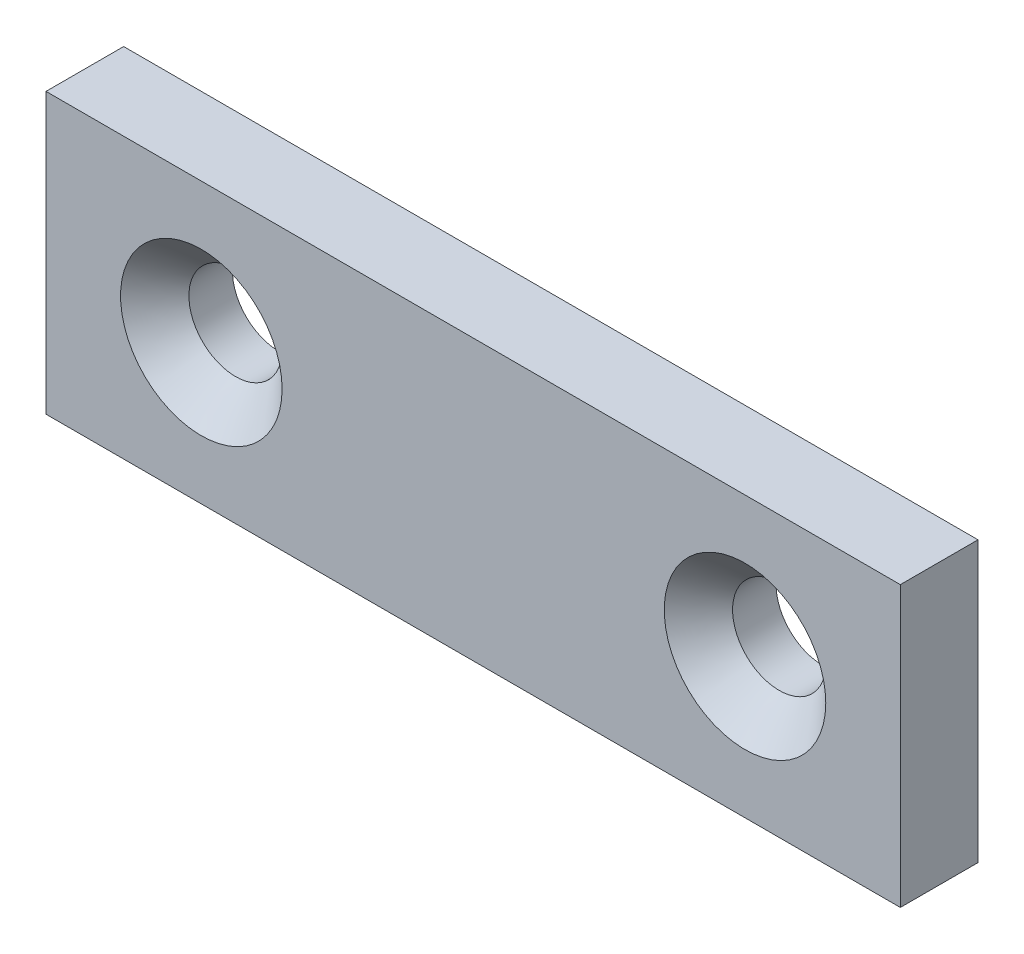
ISO-10303-21;
HEADER;
FILE_DESCRIPTION(('STEP AP214'),'2;1');
FILE_NAME('part.step','',(''),(''),'','','');
FILE_SCHEMA(('AUTOMOTIVE_DESIGN { 1 0 10303 214 1 1 1 1 }'));
ENDSEC;
DATA;
#1=APPLICATION_CONTEXT('core data for automotive mechanical design processes');
#2=APPLICATION_PROTOCOL_DEFINITION('international standard','automotive_design',2000,#1);
#3=PRODUCT_CONTEXT('',#1,'mechanical');
#4=PRODUCT('Part','Part','',(#3));
#5=PRODUCT_RELATED_PRODUCT_CATEGORY('part','',(#4));
#6=PRODUCT_DEFINITION_FORMATION('','',#4);
#7=PRODUCT_DEFINITION_CONTEXT('part definition',#1,'design');
#8=PRODUCT_DEFINITION('design','',#6,#7);
#9=PRODUCT_DEFINITION_SHAPE('','',#8);
#10=(LENGTH_UNIT() NAMED_UNIT(*) SI_UNIT(.MILLI.,.METRE.));
#11=(NAMED_UNIT(*) PLANE_ANGLE_UNIT() SI_UNIT($,.RADIAN.));
#12=(NAMED_UNIT(*) SI_UNIT($,.STERADIAN.) SOLID_ANGLE_UNIT());
#13=UNCERTAINTY_MEASURE_WITH_UNIT(LENGTH_MEASURE(1.E-05),#10,'distance_accuracy_value','');
#14=(GEOMETRIC_REPRESENTATION_CONTEXT(3) GLOBAL_UNCERTAINTY_ASSIGNED_CONTEXT((#13)) GLOBAL_UNIT_ASSIGNED_CONTEXT((#10,
#11,#12)) REPRESENTATION_CONTEXT('',''));
#15=CARTESIAN_POINT('',(0.,0.,0.));
#16=DIRECTION('',(0.,0.,1.));
#17=DIRECTION('',(1.,0.,0.));
#18=AXIS2_PLACEMENT_3D('',#15,#16,#17);
#19=CARTESIAN_POINT('',(0.,0.,2.5));
#20=DIRECTION('',(1.,0.,0.));
#21=DIRECTION('',(0.,0.,-1.));
#22=AXIS2_PLACEMENT_3D('',#19,#20,#21);
#23=PLANE('',#22);
#24=DIRECTION('',(0.,-1.,0.));
#25=VECTOR('',#24,1.);
#26=CARTESIAN_POINT('',(0.,0.,-2.5));
#27=LINE('',#26,#25);
#28=CARTESIAN_POINT('',(0.,18.,-2.5));
#29=VERTEX_POINT('',#28);
#30=CARTESIAN_POINT('',(0.,0.,-2.5));
#31=VERTEX_POINT('',#30);
#32=EDGE_CURVE('E97',#29,#31,#27,.T.);
#33=ORIENTED_EDGE('',*,*,#32,.T.);
#34=DIRECTION('',(0.,0.,-1.));
#35=VECTOR('',#34,1.);
#36=CARTESIAN_POINT('',(0.,0.,2.5));
#37=LINE('',#36,#35);
#38=CARTESIAN_POINT('',(0.,0.,2.5));
#39=VERTEX_POINT('',#38);
#40=EDGE_CURVE('E11',#39,#31,#37,.T.);
#41=ORIENTED_EDGE('',*,*,#40,.F.);
#42=DIRECTION('',(0.,-1.,0.));
#43=VECTOR('',#42,1.);
#44=CARTESIAN_POINT('',(0.,0.,2.5));
#45=LINE('',#44,#43);
#46=CARTESIAN_POINT('',(0.,18.,2.5));
#47=VERTEX_POINT('',#46);
#48=EDGE_CURVE('E85',#47,#39,#45,.T.);
#49=ORIENTED_EDGE('',*,*,#48,.F.);
#50=DIRECTION('',(0.,0.,-1.));
#51=VECTOR('',#50,1.);
#52=CARTESIAN_POINT('',(0.,18.,2.5));
#53=LINE('',#52,#51);
#54=EDGE_CURVE('E93',#47,#29,#53,.T.);
#55=ORIENTED_EDGE('',*,*,#54,.T.);
#56=EDGE_LOOP('',(#33,#41,#49,#55));
#57=FACE_BOUND('',#56,.T.);
#58=ADVANCED_FACE('F34',(#57),#23,.F.);
#59=CARTESIAN_POINT('',(0.,0.,2.5));
#60=DIRECTION('',(0.,1.,0.));
#61=DIRECTION('',(0.,0.,1.));
#62=AXIS2_PLACEMENT_3D('',#59,#60,#61);
#63=PLANE('',#62);
#64=DIRECTION('',(1.,0.,0.));
#65=VECTOR('',#64,1.);
#66=CARTESIAN_POINT('',(0.,0.,-2.5));
#67=LINE('',#66,#65);
#68=CARTESIAN_POINT('',(55.,0.,-2.5));
#69=VERTEX_POINT('',#68);
#70=EDGE_CURVE('E89',#31,#69,#67,.T.);
#71=ORIENTED_EDGE('',*,*,#70,.T.);
#72=DIRECTION('',(0.,0.,-1.));
#73=VECTOR('',#72,1.);
#74=CARTESIAN_POINT('',(55.,0.,2.5));
#75=LINE('',#74,#73);
#76=CARTESIAN_POINT('',(55.,0.,2.5));
#77=VERTEX_POINT('',#76);
#78=EDGE_CURVE('E42',#77,#69,#75,.T.);
#79=ORIENTED_EDGE('',*,*,#78,.F.);
#80=DIRECTION('',(1.,0.,0.));
#81=VECTOR('',#80,1.);
#82=CARTESIAN_POINT('',(0.,0.,2.5));
#83=LINE('',#82,#81);
#84=EDGE_CURVE('E80',#39,#77,#83,.T.);
#85=ORIENTED_EDGE('',*,*,#84,.F.);
#86=ORIENTED_EDGE('',*,*,#40,.T.);
#87=EDGE_LOOP('',(#71,#79,#85,#86));
#88=FACE_BOUND('',#87,.T.);
#89=ADVANCED_FACE('F88',(#88),#63,.F.);
#90=CARTESIAN_POINT('',(55.,0.,2.5));
#91=DIRECTION('',(-1.,0.,0.));
#92=DIRECTION('',(0.,0.,1.));
#93=AXIS2_PLACEMENT_3D('',#90,#91,#92);
#94=PLANE('',#93);
#95=DIRECTION('',(0.,1.,0.));
#96=VECTOR('',#95,1.);
#97=CARTESIAN_POINT('',(55.,0.,-2.5));
#98=LINE('',#97,#96);
#99=CARTESIAN_POINT('',(55.,18.,-2.5));
#100=VERTEX_POINT('',#99);
#101=EDGE_CURVE('E67',#69,#100,#98,.T.);
#102=ORIENTED_EDGE('',*,*,#101,.T.);
#103=DIRECTION('',(0.,0.,-1.));
#104=VECTOR('',#103,1.);
#105=CARTESIAN_POINT('',(55.,18.,2.5));
#106=LINE('',#105,#104);
#107=CARTESIAN_POINT('',(55.,18.,2.5));
#108=VERTEX_POINT('',#107);
#109=EDGE_CURVE('E90',#108,#100,#106,.T.);
#110=ORIENTED_EDGE('',*,*,#109,.F.);
#111=DIRECTION('',(0.,1.,0.));
#112=VECTOR('',#111,1.);
#113=CARTESIAN_POINT('',(55.,0.,2.5));
#114=LINE('',#113,#112);
#115=EDGE_CURVE('E83',#77,#108,#114,.T.);
#116=ORIENTED_EDGE('',*,*,#115,.F.);
#117=ORIENTED_EDGE('',*,*,#78,.T.);
#118=EDGE_LOOP('',(#102,#110,#116,#117));
#119=FACE_BOUND('',#118,.T.);
#120=ADVANCED_FACE('F91',(#119),#94,.F.);
#121=CARTESIAN_POINT('',(0.,18.,2.5));
#122=DIRECTION('',(0.,-1.,0.));
#123=DIRECTION('',(0.,0.,-1.));
#124=AXIS2_PLACEMENT_3D('',#121,#122,#123);
#125=PLANE('',#124);
#126=DIRECTION('',(-1.,0.,0.));
#127=VECTOR('',#126,1.);
#128=CARTESIAN_POINT('',(0.,18.,-2.5));
#129=LINE('',#128,#127);
#130=EDGE_CURVE('E73',#100,#29,#129,.T.);
#131=ORIENTED_EDGE('',*,*,#130,.T.);
#132=ORIENTED_EDGE('',*,*,#54,.F.);
#133=DIRECTION('',(-1.,0.,0.));
#134=VECTOR('',#133,1.);
#135=CARTESIAN_POINT('',(0.,18.,2.5));
#136=LINE('',#135,#134);
#137=EDGE_CURVE('E50',#108,#47,#136,.T.);
#138=ORIENTED_EDGE('',*,*,#137,.F.);
#139=ORIENTED_EDGE('',*,*,#109,.T.);
#140=EDGE_LOOP('',(#131,#132,#138,#139));
#141=FACE_BOUND('',#140,.T.);
#142=ADVANCED_FACE('F105',(#141),#125,.F.);
#143=CARTESIAN_POINT('',(0.,0.,2.5));
#144=DIRECTION('',(0.,0.,-1.));
#145=DIRECTION('',(-1.,0.,0.));
#146=AXIS2_PLACEMENT_3D('',#143,#144,#145);
#147=PLANE('',#146);
#148=CARTESIAN_POINT('',(10.,9.,2.5));
#149=DIRECTION('',(0.,0.,1.));
#150=DIRECTION('',(1.,0.,0.));
#151=AXIS2_PLACEMENT_3D('',#148,#149,#150);
#152=CIRCLE('',#151,5.2);
#153=CARTESIAN_POINT('',(15.2,9.,2.5));
#154=VERTEX_POINT('',#153);
#155=EDGE_CURVE('E125',#154,#154,#152,.T.);
#156=ORIENTED_EDGE('',*,*,#155,.F.);
#157=EDGE_LOOP('',(#156));
#158=FACE_BOUND('',#157,.T.);
#159=CARTESIAN_POINT('',(45.,9.,2.5));
#160=DIRECTION('',(0.,0.,1.));
#161=DIRECTION('',(1.,0.,0.));
#162=AXIS2_PLACEMENT_3D('',#159,#160,#161);
#163=CIRCLE('',#162,5.2);
#164=CARTESIAN_POINT('',(50.2,9.,2.5));
#165=VERTEX_POINT('',#164);
#166=EDGE_CURVE('E116',#165,#165,#163,.T.);
#167=ORIENTED_EDGE('',*,*,#166,.F.);
#168=EDGE_LOOP('',(#167));
#169=FACE_BOUND('',#168,.T.);
#170=ORIENTED_EDGE('',*,*,#48,.T.);
#171=ORIENTED_EDGE('',*,*,#84,.T.);
#172=ORIENTED_EDGE('',*,*,#115,.T.);
#173=ORIENTED_EDGE('',*,*,#137,.T.);
#174=EDGE_LOOP('',(#170,#171,#172,#173));
#175=FACE_BOUND('',#174,.T.);
#176=ADVANCED_FACE('F81',(#158,#169,#175),#147,.F.);
#177=CARTESIAN_POINT('',(0.,0.,-2.5));
#178=DIRECTION('',(0.,0.,-1.));
#179=DIRECTION('',(-1.,0.,0.));
#180=AXIS2_PLACEMENT_3D('',#177,#178,#179);
#181=PLANE('',#180);
#182=CARTESIAN_POINT('',(10.,9.,-2.5));
#183=DIRECTION('',(0.,0.,1.));
#184=DIRECTION('',(1.,0.,0.));
#185=AXIS2_PLACEMENT_3D('',#182,#183,#184);
#186=CIRCLE('',#185,3.);
#187=CARTESIAN_POINT('',(13.,9.,-2.5));
#188=VERTEX_POINT('',#187);
#189=EDGE_CURVE('E119',#188,#188,#186,.T.);
#190=ORIENTED_EDGE('',*,*,#189,.T.);
#191=EDGE_LOOP('',(#190));
#192=FACE_BOUND('',#191,.T.);
#193=CARTESIAN_POINT('',(45.,9.,-2.5));
#194=DIRECTION('',(0.,0.,1.));
#195=DIRECTION('',(1.,0.,0.));
#196=AXIS2_PLACEMENT_3D('',#193,#194,#195);
#197=CIRCLE('',#196,3.);
#198=CARTESIAN_POINT('',(48.,9.,-2.5));
#199=VERTEX_POINT('',#198);
#200=EDGE_CURVE('E100',#199,#199,#197,.T.);
#201=ORIENTED_EDGE('',*,*,#200,.T.);
#202=EDGE_LOOP('',(#201));
#203=FACE_BOUND('',#202,.T.);
#204=ORIENTED_EDGE('',*,*,#32,.F.);
#205=ORIENTED_EDGE('',*,*,#130,.F.);
#206=ORIENTED_EDGE('',*,*,#101,.F.);
#207=ORIENTED_EDGE('',*,*,#70,.F.);
#208=EDGE_LOOP('',(#204,#205,#206,#207));
#209=FACE_BOUND('',#208,.T.);
#210=ADVANCED_FACE('F108',(#192,#203,#209),#181,.T.);
#211=CARTESIAN_POINT('',(45.,9.,2.5));
#212=DIRECTION('',(0.,0.,1.));
#213=DIRECTION('',(1.,0.,0.));
#214=AXIS2_PLACEMENT_3D('',#211,#212,#213);
#215=CYLINDRICAL_SURFACE('',#214,3.);
#216=ORIENTED_EDGE('',*,*,#200,.F.);
#217=EDGE_LOOP('',(#216));
#218=FACE_BOUND('',#217,.T.);
#219=CARTESIAN_POINT('',(45.,9.,0.300000000000002));
#220=DIRECTION('',(0.,0.,1.));
#221=DIRECTION('',(1.,0.,0.));
#222=AXIS2_PLACEMENT_3D('',#219,#220,#221);
#223=CIRCLE('',#222,3.);
#224=CARTESIAN_POINT('',(48.,9.,0.300000000000002));
#225=VERTEX_POINT('',#224);
#226=EDGE_CURVE('E113',#225,#225,#223,.T.);
#227=ORIENTED_EDGE('',*,*,#226,.T.);
#228=EDGE_LOOP('',(#227));
#229=FACE_BOUND('',#228,.T.);
#230=ADVANCED_FACE('F139',(#218,#229),#215,.F.);
#231=CARTESIAN_POINT('',(45.,9.,2.5));
#232=DIRECTION('',(0.,0.,1.));
#233=DIRECTION('',(1.,0.,0.));
#234=AXIS2_PLACEMENT_3D('',#231,#232,#233);
#235=CONICAL_SURFACE('',#234,5.2,0.785398163397449);
#236=ORIENTED_EDGE('',*,*,#226,.F.);
#237=EDGE_LOOP('',(#236));
#238=FACE_BOUND('',#237,.T.);
#239=ORIENTED_EDGE('',*,*,#166,.T.);
#240=EDGE_LOOP('',(#239));
#241=FACE_BOUND('',#240,.T.);
#242=ADVANCED_FACE('F136',(#238,#241),#235,.F.);
#243=CARTESIAN_POINT('',(10.,9.,2.5));
#244=DIRECTION('',(0.,0.,1.));
#245=DIRECTION('',(1.,0.,0.));
#246=AXIS2_PLACEMENT_3D('',#243,#244,#245);
#247=CYLINDRICAL_SURFACE('',#246,3.);
#248=ORIENTED_EDGE('',*,*,#189,.F.);
#249=EDGE_LOOP('',(#248));
#250=FACE_BOUND('',#249,.T.);
#251=CARTESIAN_POINT('',(10.,9.,0.300000000000001));
#252=DIRECTION('',(0.,0.,1.));
#253=DIRECTION('',(1.,0.,0.));
#254=AXIS2_PLACEMENT_3D('',#251,#252,#253);
#255=CIRCLE('',#254,3.);
#256=CARTESIAN_POINT('',(13.,9.,0.300000000000001));
#257=VERTEX_POINT('',#256);
#258=EDGE_CURVE('E122',#257,#257,#255,.T.);
#259=ORIENTED_EDGE('',*,*,#258,.T.);
#260=EDGE_LOOP('',(#259));
#261=FACE_BOUND('',#260,.T.);
#262=ADVANCED_FACE('F138',(#250,#261),#247,.F.);
#263=CARTESIAN_POINT('',(10.,9.,2.5));
#264=DIRECTION('',(0.,0.,1.));
#265=DIRECTION('',(1.,0.,0.));
#266=AXIS2_PLACEMENT_3D('',#263,#264,#265);
#267=CONICAL_SURFACE('',#266,5.2,0.785398163397449);
#268=ORIENTED_EDGE('',*,*,#258,.F.);
#269=EDGE_LOOP('',(#268));
#270=FACE_BOUND('',#269,.T.);
#271=ORIENTED_EDGE('',*,*,#155,.T.);
#272=EDGE_LOOP('',(#271));
#273=FACE_BOUND('',#272,.T.);
#274=ADVANCED_FACE('F129',(#270,#273),#267,.F.);
#275=CLOSED_SHELL('',(#58,#89,#120,#142,#176,#210,#230,#242,#262,#274));
#276=MANIFOLD_SOLID_BREP('B2',#275);
#277=ADVANCED_BREP_SHAPE_REPRESENTATION('',(#18,#276),#14);
#278=SHAPE_DEFINITION_REPRESENTATION(#9,#277);
ENDSEC;
END-ISO-10303-21;
